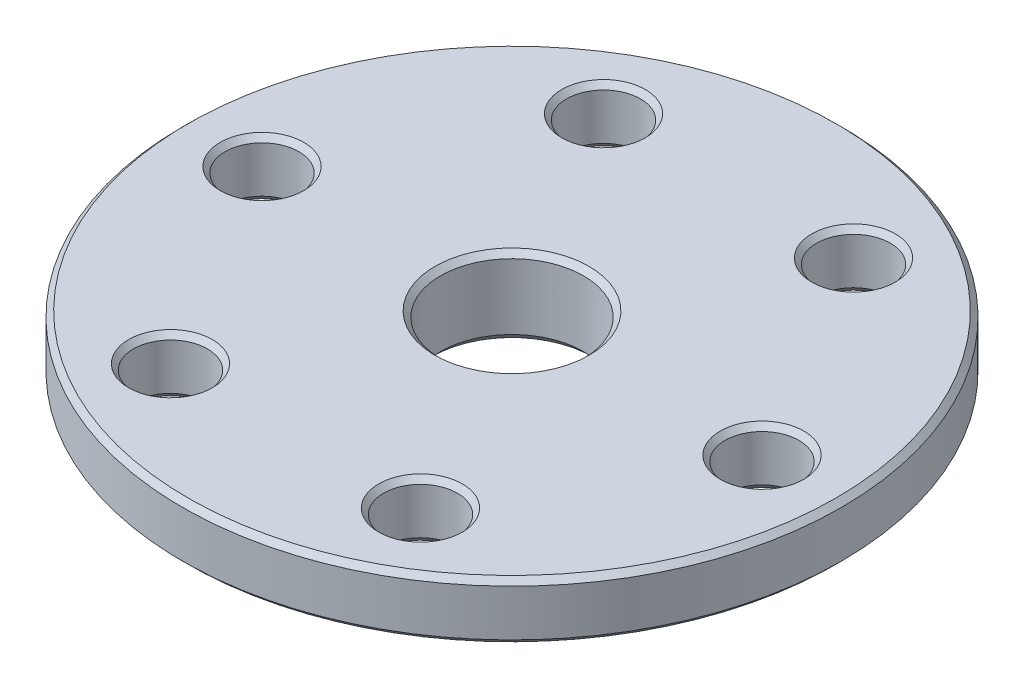
ISO-10303-21;
HEADER;
FILE_DESCRIPTION(('STEP AP214'),'2;1');
FILE_NAME('part.step','',(''),(''),'','','');
FILE_SCHEMA(('AUTOMOTIVE_DESIGN { 1 0 10303 214 1 1 1 1 }'));
ENDSEC;
DATA;
#1=APPLICATION_CONTEXT('core data for automotive mechanical design processes');
#2=APPLICATION_PROTOCOL_DEFINITION('international standard','automotive_design',2000,#1);
#3=PRODUCT_CONTEXT('',#1,'mechanical');
#4=PRODUCT('Part','Part','',(#3));
#5=PRODUCT_RELATED_PRODUCT_CATEGORY('part','',(#4));
#6=PRODUCT_DEFINITION_FORMATION('','',#4);
#7=PRODUCT_DEFINITION_CONTEXT('part definition',#1,'design');
#8=PRODUCT_DEFINITION('design','',#6,#7);
#9=PRODUCT_DEFINITION_SHAPE('','',#8);
#10=(LENGTH_UNIT() NAMED_UNIT(*) SI_UNIT(.MILLI.,.METRE.));
#11=(NAMED_UNIT(*) PLANE_ANGLE_UNIT() SI_UNIT($,.RADIAN.));
#12=(NAMED_UNIT(*) SI_UNIT($,.STERADIAN.) SOLID_ANGLE_UNIT());
#13=UNCERTAINTY_MEASURE_WITH_UNIT(LENGTH_MEASURE(1.E-05),#10,'distance_accuracy_value','');
#14=(GEOMETRIC_REPRESENTATION_CONTEXT(3) GLOBAL_UNCERTAINTY_ASSIGNED_CONTEXT((#13)) GLOBAL_UNIT_ASSIGNED_CONTEXT((#10,
#11,#12)) REPRESENTATION_CONTEXT('',''));
#15=CARTESIAN_POINT('',(0.,0.,0.));
#16=DIRECTION('',(0.,0.,1.));
#17=DIRECTION('',(1.,0.,0.));
#18=AXIS2_PLACEMENT_3D('',#15,#16,#17);
#19=CARTESIAN_POINT('',(0.,-8.71595519978993,0.));
#20=DIRECTION('',(0.,-1.,0.));
#21=DIRECTION('',(1.,0.,0.));
#22=AXIS2_PLACEMENT_3D('',#19,#20,#21);
#23=CYLINDRICAL_SURFACE('',#22,10.);
#24=CARTESIAN_POINT('',(0.,4.83800000000002,0.));
#25=DIRECTION('',(0.,-1.,0.));
#26=DIRECTION('',(1.,0.,0.));
#27=AXIS2_PLACEMENT_3D('',#24,#25,#26);
#28=CIRCLE('',#27,10.);
#29=CARTESIAN_POINT('',(10.,4.83800000000002,0.));
#30=VERTEX_POINT('',#29);
#31=EDGE_CURVE('E58',#30,#30,#28,.F.);
#32=ORIENTED_EDGE('',*,*,#31,.T.);
#33=EDGE_LOOP('',(#32));
#34=FACE_BOUND('',#33,.T.);
#35=CARTESIAN_POINT('',(0.,-4.33,0.));
#36=DIRECTION('',(0.,1.,0.));
#37=DIRECTION('',(-1.,0.,0.));
#38=AXIS2_PLACEMENT_3D('',#35,#36,#37);
#39=CIRCLE('',#38,10.);
#40=CARTESIAN_POINT('',(-10.,-4.33,0.));
#41=VERTEX_POINT('',#40);
#42=EDGE_CURVE('E83',#41,#41,#39,.F.);
#43=ORIENTED_EDGE('',*,*,#42,.T.);
#44=EDGE_LOOP('',(#43));
#45=FACE_BOUND('',#44,.T.);
#46=ADVANCED_FACE('F38',(#34,#45),#23,.F.);
#47=CARTESIAN_POINT('',(-46.0375,5.60000000000001,0.));
#48=DIRECTION('',(0.,-1.,0.));
#49=DIRECTION('',(1.,0.,0.));
#50=AXIS2_PLACEMENT_3D('',#47,#48,#49);
#51=PLANE('',#50);
#52=CARTESIAN_POINT('',(0.,5.60000000000001,0.));
#53=DIRECTION('',(0.,-1.,0.));
#54=DIRECTION('',(1.,0.,0.));
#55=AXIS2_PLACEMENT_3D('',#52,#53,#54);
#56=CIRCLE('',#55,45.2755);
#57=CARTESIAN_POINT('',(45.2755,5.60000000000001,0.));
#58=VERTEX_POINT('',#57);
#59=EDGE_CURVE('E64',#58,#58,#56,.F.);
#60=ORIENTED_EDGE('',*,*,#59,.T.);
#61=EDGE_LOOP('',(#60));
#62=FACE_BOUND('',#61,.T.);
#63=CARTESIAN_POINT('',(0.,5.60000000000001,0.));
#64=DIRECTION('',(0.,-1.,0.));
#65=DIRECTION('',(1.,0.,0.));
#66=AXIS2_PLACEMENT_3D('',#63,#64,#65);
#67=CIRCLE('',#66,10.762);
#68=CARTESIAN_POINT('',(10.762,5.60000000000001,0.));
#69=VERTEX_POINT('',#68);
#70=EDGE_CURVE('E68',#69,#69,#67,.T.);
#71=ORIENTED_EDGE('',*,*,#70,.T.);
#72=EDGE_LOOP('',(#71));
#73=FACE_BOUND('',#72,.T.);
#74=CARTESIAN_POINT('',(17.4625000000001,5.60000000000001,-30.2459372271714));
#75=DIRECTION('',(0.,1.,0.));
#76=DIRECTION('',(0.,0.,1.));
#77=AXIS2_PLACEMENT_3D('',#74,#75,#76);
#78=CIRCLE('',#77,5.842);
#79=CARTESIAN_POINT('',(17.4625000000001,5.60000000000001,-24.4039372271714));
#80=VERTEX_POINT('',#79);
#81=EDGE_CURVE('E170',#80,#80,#78,.T.);
#82=ORIENTED_EDGE('',*,*,#81,.F.);
#83=EDGE_LOOP('',(#82));
#84=FACE_BOUND('',#83,.T.);
#85=CARTESIAN_POINT('',(-17.4624999999999,5.60000000000001,-30.2459372271718));
#86=DIRECTION('',(0.,1.,0.));
#87=DIRECTION('',(0.,0.,1.));
#88=AXIS2_PLACEMENT_3D('',#85,#86,#87);
#89=CIRCLE('',#88,5.842);
#90=CARTESIAN_POINT('',(-17.4624999999999,5.60000000000001,-24.4039372271718));
#91=VERTEX_POINT('',#90);
#92=EDGE_CURVE('E154',#91,#91,#89,.T.);
#93=ORIENTED_EDGE('',*,*,#92,.F.);
#94=EDGE_LOOP('',(#93));
#95=FACE_BOUND('',#94,.T.);
#96=CARTESIAN_POINT('',(-34.9250000000001,5.60000000000001,-2.4980018054066E-13));
#97=DIRECTION('',(0.,1.,0.));
#98=DIRECTION('',(0.,0.,1.));
#99=AXIS2_PLACEMENT_3D('',#96,#97,#98);
#100=CIRCLE('',#99,5.842);
#101=CARTESIAN_POINT('',(-34.9250000000001,5.60000000000001,5.84199999999976));
#102=VERTEX_POINT('',#101);
#103=EDGE_CURVE('E138',#102,#102,#100,.T.);
#104=ORIENTED_EDGE('',*,*,#103,.F.);
#105=EDGE_LOOP('',(#104));
#106=FACE_BOUND('',#105,.T.);
#107=CARTESIAN_POINT('',(-17.4625000000002,5.60000000000002,30.2459372271716));
#108=DIRECTION('',(0.,1.,0.));
#109=DIRECTION('',(0.,0.,1.));
#110=AXIS2_PLACEMENT_3D('',#107,#108,#109);
#111=CIRCLE('',#110,5.842);
#112=CARTESIAN_POINT('',(-17.4625000000002,5.60000000000002,36.0879372271717));
#113=VERTEX_POINT('',#112);
#114=EDGE_CURVE('E122',#113,#113,#111,.T.);
#115=ORIENTED_EDGE('',*,*,#114,.F.);
#116=EDGE_LOOP('',(#115));
#117=FACE_BOUND('',#116,.T.);
#118=CARTESIAN_POINT('',(17.4624999999999,5.60000000000002,30.2459372271716));
#119=DIRECTION('',(0.,1.,0.));
#120=DIRECTION('',(0.,0.,1.));
#121=AXIS2_PLACEMENT_3D('',#118,#119,#120);
#122=CIRCLE('',#121,5.842);
#123=CARTESIAN_POINT('',(17.4624999999999,5.60000000000002,36.0879372271716));
#124=VERTEX_POINT('',#123);
#125=EDGE_CURVE('E106',#124,#124,#122,.T.);
#126=ORIENTED_EDGE('',*,*,#125,.F.);
#127=EDGE_LOOP('',(#126));
#128=FACE_BOUND('',#127,.T.);
#129=CARTESIAN_POINT('',(34.925,5.60000000000006,0.));
#130=DIRECTION('',(0.,1.,0.));
#131=DIRECTION('',(0.,0.,1.));
#132=AXIS2_PLACEMENT_3D('',#129,#130,#131);
#133=CIRCLE('',#132,5.842);
#134=CARTESIAN_POINT('',(34.925,5.60000000000006,5.84200000000001));
#135=VERTEX_POINT('',#134);
#136=EDGE_CURVE('E90',#135,#135,#133,.T.);
#137=ORIENTED_EDGE('',*,*,#136,.F.);
#138=EDGE_LOOP('',(#137));
#139=FACE_BOUND('',#138,.T.);
#140=ADVANCED_FACE('F210',(#62,#73,#84,#95,#106,#117,#128,#139),#51,.F.);
#141=CARTESIAN_POINT('',(0.,-8.71595519978993,0.));
#142=DIRECTION('',(0.,-1.,0.));
#143=DIRECTION('',(1.,0.,0.));
#144=AXIS2_PLACEMENT_3D('',#141,#142,#143);
#145=CYLINDRICAL_SURFACE('',#144,46.0375);
#146=CARTESIAN_POINT('',(0.,4.83800000000002,0.));
#147=DIRECTION('',(0.,-1.,0.));
#148=DIRECTION('',(1.,0.,0.));
#149=AXIS2_PLACEMENT_3D('',#146,#147,#148);
#150=CIRCLE('',#149,46.0375);
#151=CARTESIAN_POINT('',(46.0375,4.83800000000003,0.));
#152=VERTEX_POINT('',#151);
#153=EDGE_CURVE('E72',#152,#152,#150,.T.);
#154=ORIENTED_EDGE('',*,*,#153,.T.);
#155=EDGE_LOOP('',(#154));
#156=FACE_BOUND('',#155,.T.);
#157=CARTESIAN_POINT('',(0.,-1.66300000000004,0.));
#158=DIRECTION('',(0.,1.,0.));
#159=DIRECTION('',(-1.,0.,0.));
#160=AXIS2_PLACEMENT_3D('',#157,#158,#159);
#161=CIRCLE('',#160,46.0375);
#162=CARTESIAN_POINT('',(-46.0375,-1.66300000000005,0.));
#163=VERTEX_POINT('',#162);
#164=EDGE_CURVE('E76',#163,#163,#161,.T.);
#165=ORIENTED_EDGE('',*,*,#164,.T.);
#166=EDGE_LOOP('',(#165));
#167=FACE_BOUND('',#166,.T.);
#168=ADVANCED_FACE('F213',(#156,#167),#145,.T.);
#169=CARTESIAN_POINT('',(-46.0375,-2.425,0.));
#170=DIRECTION('',(0.,1.,0.));
#171=DIRECTION('',(-1.,0.,0.));
#172=AXIS2_PLACEMENT_3D('',#169,#170,#171);
#173=PLANE('',#172);
#174=CARTESIAN_POINT('',(0.,-2.425,0.));
#175=DIRECTION('',(0.,1.,0.));
#176=DIRECTION('',(-1.,0.,0.));
#177=AXIS2_PLACEMENT_3D('',#174,#175,#176);
#178=CIRCLE('',#177,45.2755);
#179=CARTESIAN_POINT('',(-45.2755,-2.425,0.));
#180=VERTEX_POINT('',#179);
#181=EDGE_CURVE('E52',#180,#180,#178,.F.);
#182=ORIENTED_EDGE('',*,*,#181,.T.);
#183=EDGE_LOOP('',(#182));
#184=FACE_BOUND('',#183,.T.);
#185=CARTESIAN_POINT('',(17.4625000000001,-2.42499999999998,-30.2459372271714));
#186=DIRECTION('',(0.,1.,0.));
#187=DIRECTION('',(0.,0.,1.));
#188=AXIS2_PLACEMENT_3D('',#185,#186,#187);
#189=CIRCLE('',#188,5.842);
#190=CARTESIAN_POINT('',(17.4625000000001,-2.42499999999998,-24.4039372271714));
#191=VERTEX_POINT('',#190);
#192=EDGE_CURVE('E182',#191,#191,#189,.T.);
#193=ORIENTED_EDGE('',*,*,#192,.T.);
#194=EDGE_LOOP('',(#193));
#195=FACE_BOUND('',#194,.T.);
#196=CARTESIAN_POINT('',(-17.4624999999999,-2.42499999999998,-30.2459372271718));
#197=DIRECTION('',(0.,1.,0.));
#198=DIRECTION('',(0.,0.,1.));
#199=AXIS2_PLACEMENT_3D('',#196,#197,#198);
#200=CIRCLE('',#199,5.842);
#201=CARTESIAN_POINT('',(-17.4624999999999,-2.42499999999998,-24.4039372271718));
#202=VERTEX_POINT('',#201);
#203=EDGE_CURVE('E166',#202,#202,#200,.T.);
#204=ORIENTED_EDGE('',*,*,#203,.T.);
#205=EDGE_LOOP('',(#204));
#206=FACE_BOUND('',#205,.T.);
#207=CARTESIAN_POINT('',(-34.925,-2.42499999999998,-2.4980018054066E-13));
#208=DIRECTION('',(0.,1.,0.));
#209=DIRECTION('',(0.,0.,1.));
#210=AXIS2_PLACEMENT_3D('',#207,#208,#209);
#211=CIRCLE('',#210,5.842);
#212=CARTESIAN_POINT('',(-34.925,-2.42499999999998,5.84199999999976));
#213=VERTEX_POINT('',#212);
#214=EDGE_CURVE('E150',#213,#213,#211,.T.);
#215=ORIENTED_EDGE('',*,*,#214,.T.);
#216=EDGE_LOOP('',(#215));
#217=FACE_BOUND('',#216,.T.);
#218=CARTESIAN_POINT('',(-17.4625000000002,-2.42499999999997,30.2459372271715));
#219=DIRECTION('',(0.,1.,0.));
#220=DIRECTION('',(0.,0.,1.));
#221=AXIS2_PLACEMENT_3D('',#218,#219,#220);
#222=CIRCLE('',#221,5.842);
#223=CARTESIAN_POINT('',(-17.4625000000002,-2.42499999999997,36.0879372271715));
#224=VERTEX_POINT('',#223);
#225=EDGE_CURVE('E134',#224,#224,#222,.T.);
#226=ORIENTED_EDGE('',*,*,#225,.T.);
#227=EDGE_LOOP('',(#226));
#228=FACE_BOUND('',#227,.T.);
#229=CARTESIAN_POINT('',(17.4624999999999,-2.42499999999997,30.2459372271716));
#230=DIRECTION('',(0.,1.,0.));
#231=DIRECTION('',(0.,0.,1.));
#232=AXIS2_PLACEMENT_3D('',#229,#230,#231);
#233=CIRCLE('',#232,5.842);
#234=CARTESIAN_POINT('',(17.4624999999999,-2.42499999999997,36.0879372271716));
#235=VERTEX_POINT('',#234);
#236=EDGE_CURVE('E118',#235,#235,#233,.T.);
#237=ORIENTED_EDGE('',*,*,#236,.T.);
#238=EDGE_LOOP('',(#237));
#239=FACE_BOUND('',#238,.T.);
#240=CARTESIAN_POINT('',(34.925,-2.42499999999994,0.));
#241=DIRECTION('',(0.,1.,0.));
#242=DIRECTION('',(0.,0.,1.));
#243=AXIS2_PLACEMENT_3D('',#240,#241,#242);
#244=CIRCLE('',#243,5.842);
#245=CARTESIAN_POINT('',(34.925,-2.42499999999994,5.84200000000001));
#246=VERTEX_POINT('',#245);
#247=EDGE_CURVE('E102',#246,#246,#244,.T.);
#248=ORIENTED_EDGE('',*,*,#247,.T.);
#249=EDGE_LOOP('',(#248));
#250=FACE_BOUND('',#249,.T.);
#251=CARTESIAN_POINT('',(0.,-2.425,0.));
#252=DIRECTION('',(0.,-1.,0.));
#253=DIRECTION('',(1.,0.,0.));
#254=AXIS2_PLACEMENT_3D('',#251,#252,#253);
#255=CIRCLE('',#254,25.3873);
#256=CARTESIAN_POINT('',(25.3873,-2.42499999999999,0.));
#257=VERTEX_POINT('',#256);
#258=EDGE_CURVE('E87',#257,#257,#255,.T.);
#259=ORIENTED_EDGE('',*,*,#258,.F.);
#260=EDGE_LOOP('',(#259));
#261=FACE_BOUND('',#260,.T.);
#262=ADVANCED_FACE('F187',(#184,#195,#206,#217,#228,#239,#250,#261),#173,.F.);
#263=CARTESIAN_POINT('',(0.,-8.71595519978993,0.));
#264=DIRECTION('',(0.,-1.,0.));
#265=DIRECTION('',(1.,0.,0.));
#266=AXIS2_PLACEMENT_3D('',#263,#264,#265);
#267=CYLINDRICAL_SURFACE('',#266,25.3873);
#268=CARTESIAN_POINT('',(0.,-4.83800000000004,0.));
#269=DIRECTION('',(0.,1.,0.));
#270=DIRECTION('',(-1.,0.,0.));
#271=AXIS2_PLACEMENT_3D('',#268,#269,#270);
#272=CIRCLE('',#271,25.3873);
#273=CARTESIAN_POINT('',(-25.3873,-4.83800000000004,0.));
#274=VERTEX_POINT('',#273);
#275=EDGE_CURVE('E10',#274,#274,#272,.T.);
#276=ORIENTED_EDGE('',*,*,#275,.T.);
#277=EDGE_LOOP('',(#276));
#278=FACE_BOUND('',#277,.T.);
#279=ORIENTED_EDGE('',*,*,#258,.T.);
#280=EDGE_LOOP('',(#279));
#281=FACE_BOUND('',#280,.T.);
#282=ADVANCED_FACE('F239',(#278,#281),#267,.T.);
#283=CARTESIAN_POINT('',(-10.,-5.59999999999999,0.));
#284=DIRECTION('',(0.,1.,0.));
#285=DIRECTION('',(-1.,0.,0.));
#286=AXIS2_PLACEMENT_3D('',#283,#284,#285);
#287=PLANE('',#286);
#288=CARTESIAN_POINT('',(0.,-5.59999999999999,0.));
#289=DIRECTION('',(0.,1.,0.));
#290=DIRECTION('',(-1.,0.,0.));
#291=AXIS2_PLACEMENT_3D('',#288,#289,#290);
#292=CIRCLE('',#291,24.6253);
#293=CARTESIAN_POINT('',(-24.6253000000001,-5.6,0.));
#294=VERTEX_POINT('',#293);
#295=EDGE_CURVE('E46',#294,#294,#292,.F.);
#296=ORIENTED_EDGE('',*,*,#295,.T.);
#297=EDGE_LOOP('',(#296));
#298=FACE_BOUND('',#297,.T.);
#299=CARTESIAN_POINT('',(0.,-5.59999999999999,0.));
#300=DIRECTION('',(0.,1.,0.));
#301=DIRECTION('',(-1.,0.,0.));
#302=AXIS2_PLACEMENT_3D('',#299,#300,#301);
#303=CIRCLE('',#302,11.27);
#304=CARTESIAN_POINT('',(-11.27,-5.6,0.));
#305=VERTEX_POINT('',#304);
#306=EDGE_CURVE('E80',#305,#305,#303,.T.);
#307=ORIENTED_EDGE('',*,*,#306,.T.);
#308=EDGE_LOOP('',(#307));
#309=FACE_BOUND('',#308,.T.);
#310=ADVANCED_FACE('F229',(#298,#309),#287,.F.);
#311=CARTESIAN_POINT('',(34.925,5.60000000000006,0.));
#312=DIRECTION('',(0.,1.,0.));
#313=DIRECTION('',(0.,0.,1.));
#314=AXIS2_PLACEMENT_3D('',#311,#312,#313);
#315=CONICAL_SURFACE('',#314,5.842,0.715584993317674);
#316=CARTESIAN_POINT('',(34.925,4.81399928208223,0.));
#317=DIRECTION('',(0.,1.,0.));
#318=DIRECTION('',(0.,0.,1.));
#319=AXIS2_PLACEMENT_3D('',#316,#317,#318);
#320=CIRCLE('',#319,5.15874);
#321=CARTESIAN_POINT('',(34.925,4.81399928208223,5.15874000000001));
#322=VERTEX_POINT('',#321);
#323=EDGE_CURVE('E94',#322,#322,#320,.T.);
#324=ORIENTED_EDGE('',*,*,#323,.F.);
#325=EDGE_LOOP('',(#324));
#326=FACE_BOUND('',#325,.T.);
#327=ORIENTED_EDGE('',*,*,#136,.T.);
#328=EDGE_LOOP('',(#327));
#329=FACE_BOUND('',#328,.T.);
#330=ADVANCED_FACE('F226',(#326,#329),#315,.F.);
#331=CARTESIAN_POINT('',(34.925,5.60000000000006,0.));
#332=DIRECTION('',(0.,1.,0.));
#333=DIRECTION('',(0.,0.,1.));
#334=AXIS2_PLACEMENT_3D('',#331,#332,#333);
#335=CYLINDRICAL_SURFACE('',#334,5.15874);
#336=CARTESIAN_POINT('',(34.925,-1.63899928208211,0.));
#337=DIRECTION('',(0.,1.,0.));
#338=DIRECTION('',(0.,0.,1.));
#339=AXIS2_PLACEMENT_3D('',#336,#337,#338);
#340=CIRCLE('',#339,5.15873999999999);
#341=CARTESIAN_POINT('',(34.925,-1.63899928208211,5.15874));
#342=VERTEX_POINT('',#341);
#343=EDGE_CURVE('E98',#342,#342,#340,.T.);
#344=ORIENTED_EDGE('',*,*,#343,.F.);
#345=EDGE_LOOP('',(#344));
#346=FACE_BOUND('',#345,.T.);
#347=ORIENTED_EDGE('',*,*,#323,.T.);
#348=EDGE_LOOP('',(#347));
#349=FACE_BOUND('',#348,.T.);
#350=ADVANCED_FACE('F228',(#346,#349),#335,.F.);
#351=CARTESIAN_POINT('',(34.925,-1.63899928208211,0.));
#352=DIRECTION('',(0.,-1.,0.));
#353=DIRECTION('',(0.,0.,-1.));
#354=AXIS2_PLACEMENT_3D('',#351,#352,#353);
#355=CONICAL_SURFACE('',#354,5.15873999999999,0.715584993317678);
#356=ORIENTED_EDGE('',*,*,#247,.F.);
#357=EDGE_LOOP('',(#356));
#358=FACE_BOUND('',#357,.T.);
#359=ORIENTED_EDGE('',*,*,#343,.T.);
#360=EDGE_LOOP('',(#359));
#361=FACE_BOUND('',#360,.T.);
#362=ADVANCED_FACE('F236',(#358,#361),#355,.F.);
#363=CARTESIAN_POINT('',(17.4624999999999,5.60000000000002,30.2459372271716));
#364=DIRECTION('',(0.,1.,0.));
#365=DIRECTION('',(0.,0.,1.));
#366=AXIS2_PLACEMENT_3D('',#363,#364,#365);
#367=CONICAL_SURFACE('',#366,5.842,0.715584993317677);
#368=CARTESIAN_POINT('',(17.4624999999999,4.8139992820822,30.2459372271716));
#369=DIRECTION('',(0.,1.,0.));
#370=DIRECTION('',(0.,0.,1.));
#371=AXIS2_PLACEMENT_3D('',#368,#369,#370);
#372=CIRCLE('',#371,5.15874);
#373=CARTESIAN_POINT('',(17.4624999999999,4.8139992820822,35.4046772271716));
#374=VERTEX_POINT('',#373);
#375=EDGE_CURVE('E110',#374,#374,#372,.T.);
#376=ORIENTED_EDGE('',*,*,#375,.F.);
#377=EDGE_LOOP('',(#376));
#378=FACE_BOUND('',#377,.T.);
#379=ORIENTED_EDGE('',*,*,#125,.T.);
#380=EDGE_LOOP('',(#379));
#381=FACE_BOUND('',#380,.T.);
#382=ADVANCED_FACE('F335',(#378,#381),#367,.F.);
#383=CARTESIAN_POINT('',(17.4624999999999,5.60000000000002,30.2459372271716));
#384=DIRECTION('',(0.,1.,0.));
#385=DIRECTION('',(0.,0.,1.));
#386=AXIS2_PLACEMENT_3D('',#383,#384,#385);
#387=CYLINDRICAL_SURFACE('',#386,5.15874);
#388=CARTESIAN_POINT('',(17.4624999999999,-1.63899928208214,30.2459372271716));
#389=DIRECTION('',(0.,1.,0.));
#390=DIRECTION('',(0.,0.,1.));
#391=AXIS2_PLACEMENT_3D('',#388,#389,#390);
#392=CIRCLE('',#391,5.15874);
#393=CARTESIAN_POINT('',(17.4624999999999,-1.63899928208214,35.4046772271716));
#394=VERTEX_POINT('',#393);
#395=EDGE_CURVE('E114',#394,#394,#392,.T.);
#396=ORIENTED_EDGE('',*,*,#395,.F.);
#397=EDGE_LOOP('',(#396));
#398=FACE_BOUND('',#397,.T.);
#399=ORIENTED_EDGE('',*,*,#375,.T.);
#400=EDGE_LOOP('',(#399));
#401=FACE_BOUND('',#400,.T.);
#402=ADVANCED_FACE('F345',(#398,#401),#387,.F.);
#403=CARTESIAN_POINT('',(17.4624999999999,-1.63899928208214,30.2459372271716));
#404=DIRECTION('',(0.,-1.,0.));
#405=DIRECTION('',(0.,0.,-1.));
#406=AXIS2_PLACEMENT_3D('',#403,#404,#405);
#407=CONICAL_SURFACE('',#406,5.15874,0.715584993317673);
#408=ORIENTED_EDGE('',*,*,#236,.F.);
#409=EDGE_LOOP('',(#408));
#410=FACE_BOUND('',#409,.T.);
#411=ORIENTED_EDGE('',*,*,#395,.T.);
#412=EDGE_LOOP('',(#411));
#413=FACE_BOUND('',#412,.T.);
#414=ADVANCED_FACE('F355',(#410,#413),#407,.F.);
#415=CARTESIAN_POINT('',(-17.4625000000002,5.60000000000002,30.2459372271716));
#416=DIRECTION('',(0.,1.,0.));
#417=DIRECTION('',(0.,0.,1.));
#418=AXIS2_PLACEMENT_3D('',#415,#416,#417);
#419=CONICAL_SURFACE('',#418,5.842,0.715584993317677);
#420=CARTESIAN_POINT('',(-17.4625000000002,4.8139992820822,30.2459372271716));
#421=DIRECTION('',(0.,1.,0.));
#422=DIRECTION('',(0.,0.,1.));
#423=AXIS2_PLACEMENT_3D('',#420,#421,#422);
#424=CIRCLE('',#423,5.15874);
#425=CARTESIAN_POINT('',(-17.4625000000002,4.8139992820822,35.4046772271717));
#426=VERTEX_POINT('',#425);
#427=EDGE_CURVE('E126',#426,#426,#424,.T.);
#428=ORIENTED_EDGE('',*,*,#427,.F.);
#429=EDGE_LOOP('',(#428));
#430=FACE_BOUND('',#429,.T.);
#431=ORIENTED_EDGE('',*,*,#114,.T.);
#432=EDGE_LOOP('',(#431));
#433=FACE_BOUND('',#432,.T.);
#434=ADVANCED_FACE('F365',(#430,#433),#419,.F.);
#435=CARTESIAN_POINT('',(-17.4625000000002,5.60000000000002,30.2459372271716));
#436=DIRECTION('',(0.,1.,0.));
#437=DIRECTION('',(0.,0.,1.));
#438=AXIS2_PLACEMENT_3D('',#435,#436,#437);
#439=CYLINDRICAL_SURFACE('',#438,5.15874);
#440=CARTESIAN_POINT('',(-17.4625000000002,-1.63899928208214,30.2459372271715));
#441=DIRECTION('',(0.,1.,0.));
#442=DIRECTION('',(0.,0.,1.));
#443=AXIS2_PLACEMENT_3D('',#440,#441,#442);
#444=CIRCLE('',#443,5.15874);
#445=CARTESIAN_POINT('',(-17.4625000000002,-1.63899928208214,35.4046772271715));
#446=VERTEX_POINT('',#445);
#447=EDGE_CURVE('E130',#446,#446,#444,.T.);
#448=ORIENTED_EDGE('',*,*,#447,.F.);
#449=EDGE_LOOP('',(#448));
#450=FACE_BOUND('',#449,.T.);
#451=ORIENTED_EDGE('',*,*,#427,.T.);
#452=EDGE_LOOP('',(#451));
#453=FACE_BOUND('',#452,.T.);
#454=ADVANCED_FACE('F375',(#450,#453),#439,.F.);
#455=CARTESIAN_POINT('',(-17.4625000000002,-1.63899928208214,30.2459372271715));
#456=DIRECTION('',(0.,-1.,0.));
#457=DIRECTION('',(0.,0.,-1.));
#458=AXIS2_PLACEMENT_3D('',#455,#456,#457);
#459=CONICAL_SURFACE('',#458,5.15874,0.715584993317674);
#460=ORIENTED_EDGE('',*,*,#225,.F.);
#461=EDGE_LOOP('',(#460));
#462=FACE_BOUND('',#461,.T.);
#463=ORIENTED_EDGE('',*,*,#447,.T.);
#464=EDGE_LOOP('',(#463));
#465=FACE_BOUND('',#464,.T.);
#466=ADVANCED_FACE('F385',(#462,#465),#459,.F.);
#467=CARTESIAN_POINT('',(-34.9250000000001,5.60000000000001,-2.4980018054066E-13));
#468=DIRECTION('',(0.,1.,0.));
#469=DIRECTION('',(0.,0.,1.));
#470=AXIS2_PLACEMENT_3D('',#467,#468,#469);
#471=CONICAL_SURFACE('',#470,5.842,0.715584993317677);
#472=CARTESIAN_POINT('',(-34.9250000000001,4.81399928208218,-2.4980018054066E-13));
#473=DIRECTION('',(0.,1.,0.));
#474=DIRECTION('',(0.,0.,1.));
#475=AXIS2_PLACEMENT_3D('',#472,#473,#474);
#476=CIRCLE('',#475,5.15874);
#477=CARTESIAN_POINT('',(-34.9250000000001,4.81399928208218,5.15873999999976));
#478=VERTEX_POINT('',#477);
#479=EDGE_CURVE('E142',#478,#478,#476,.T.);
#480=ORIENTED_EDGE('',*,*,#479,.F.);
#481=EDGE_LOOP('',(#480));
#482=FACE_BOUND('',#481,.T.);
#483=ORIENTED_EDGE('',*,*,#103,.T.);
#484=EDGE_LOOP('',(#483));
#485=FACE_BOUND('',#484,.T.);
#486=ADVANCED_FACE('F395',(#482,#485),#471,.F.);
#487=CARTESIAN_POINT('',(-34.9250000000001,5.60000000000001,-2.4980018054066E-13));
#488=DIRECTION('',(0.,1.,0.));
#489=DIRECTION('',(0.,0.,1.));
#490=AXIS2_PLACEMENT_3D('',#487,#488,#489);
#491=CYLINDRICAL_SURFACE('',#490,5.15874);
#492=CARTESIAN_POINT('',(-34.925,-1.63899928208217,-2.4980018054066E-13));
#493=DIRECTION('',(0.,1.,0.));
#494=DIRECTION('',(0.,0.,1.));
#495=AXIS2_PLACEMENT_3D('',#492,#493,#494);
#496=CIRCLE('',#495,5.15874);
#497=CARTESIAN_POINT('',(-34.925,-1.63899928208217,5.15873999999976));
#498=VERTEX_POINT('',#497);
#499=EDGE_CURVE('E146',#498,#498,#496,.T.);
#500=ORIENTED_EDGE('',*,*,#499,.F.);
#501=EDGE_LOOP('',(#500));
#502=FACE_BOUND('',#501,.T.);
#503=ORIENTED_EDGE('',*,*,#479,.T.);
#504=EDGE_LOOP('',(#503));
#505=FACE_BOUND('',#504,.T.);
#506=ADVANCED_FACE('F405',(#502,#505),#491,.F.);
#507=CARTESIAN_POINT('',(-34.925,-1.63899928208217,-2.4980018054066E-13));
#508=DIRECTION('',(0.,-1.,0.));
#509=DIRECTION('',(0.,0.,-1.));
#510=AXIS2_PLACEMENT_3D('',#507,#508,#509);
#511=CONICAL_SURFACE('',#510,5.15874,0.715584993317676);
#512=ORIENTED_EDGE('',*,*,#214,.F.);
#513=EDGE_LOOP('',(#512));
#514=FACE_BOUND('',#513,.T.);
#515=ORIENTED_EDGE('',*,*,#499,.T.);
#516=EDGE_LOOP('',(#515));
#517=FACE_BOUND('',#516,.T.);
#518=ADVANCED_FACE('F415',(#514,#517),#511,.F.);
#519=CARTESIAN_POINT('',(-17.4624999999999,5.60000000000001,-30.2459372271718));
#520=DIRECTION('',(0.,1.,0.));
#521=DIRECTION('',(0.,0.,1.));
#522=AXIS2_PLACEMENT_3D('',#519,#520,#521);
#523=CONICAL_SURFACE('',#522,5.842,0.715584993317677);
#524=CARTESIAN_POINT('',(-17.4624999999999,4.81399928208218,-30.2459372271718));
#525=DIRECTION('',(0.,1.,0.));
#526=DIRECTION('',(0.,0.,1.));
#527=AXIS2_PLACEMENT_3D('',#524,#525,#526);
#528=CIRCLE('',#527,5.15874);
#529=CARTESIAN_POINT('',(-17.4624999999999,4.81399928208218,-25.0871972271718));
#530=VERTEX_POINT('',#529);
#531=EDGE_CURVE('E158',#530,#530,#528,.T.);
#532=ORIENTED_EDGE('',*,*,#531,.F.);
#533=EDGE_LOOP('',(#532));
#534=FACE_BOUND('',#533,.T.);
#535=ORIENTED_EDGE('',*,*,#92,.T.);
#536=EDGE_LOOP('',(#535));
#537=FACE_BOUND('',#536,.T.);
#538=ADVANCED_FACE('F425',(#534,#537),#523,.F.);
#539=CARTESIAN_POINT('',(-17.4624999999999,5.60000000000001,-30.2459372271718));
#540=DIRECTION('',(0.,1.,0.));
#541=DIRECTION('',(0.,0.,1.));
#542=AXIS2_PLACEMENT_3D('',#539,#540,#541);
#543=CYLINDRICAL_SURFACE('',#542,5.15874);
#544=CARTESIAN_POINT('',(-17.4624999999999,-1.63899928208215,-30.2459372271718));
#545=DIRECTION('',(0.,1.,0.));
#546=DIRECTION('',(0.,0.,1.));
#547=AXIS2_PLACEMENT_3D('',#544,#545,#546);
#548=CIRCLE('',#547,5.15874);
#549=CARTESIAN_POINT('',(-17.4624999999999,-1.63899928208215,-25.0871972271718));
#550=VERTEX_POINT('',#549);
#551=EDGE_CURVE('E162',#550,#550,#548,.T.);
#552=ORIENTED_EDGE('',*,*,#551,.F.);
#553=EDGE_LOOP('',(#552));
#554=FACE_BOUND('',#553,.T.);
#555=ORIENTED_EDGE('',*,*,#531,.T.);
#556=EDGE_LOOP('',(#555));
#557=FACE_BOUND('',#556,.T.);
#558=ADVANCED_FACE('F435',(#554,#557),#543,.F.);
#559=CARTESIAN_POINT('',(-17.4624999999999,-1.63899928208215,-30.2459372271718));
#560=DIRECTION('',(0.,-1.,0.));
#561=DIRECTION('',(0.,0.,-1.));
#562=AXIS2_PLACEMENT_3D('',#559,#560,#561);
#563=CONICAL_SURFACE('',#562,5.15874,0.715584993317674);
#564=ORIENTED_EDGE('',*,*,#203,.F.);
#565=EDGE_LOOP('',(#564));
#566=FACE_BOUND('',#565,.T.);
#567=ORIENTED_EDGE('',*,*,#551,.T.);
#568=EDGE_LOOP('',(#567));
#569=FACE_BOUND('',#568,.T.);
#570=ADVANCED_FACE('F206',(#566,#569),#563,.F.);
#571=CARTESIAN_POINT('',(17.4625000000001,5.60000000000001,-30.2459372271714));
#572=DIRECTION('',(0.,1.,0.));
#573=DIRECTION('',(0.,0.,1.));
#574=AXIS2_PLACEMENT_3D('',#571,#572,#573);
#575=CONICAL_SURFACE('',#574,5.842,0.715584993317677);
#576=CARTESIAN_POINT('',(17.4625000000001,4.81399928208219,-30.2459372271714));
#577=DIRECTION('',(0.,1.,0.));
#578=DIRECTION('',(0.,0.,1.));
#579=AXIS2_PLACEMENT_3D('',#576,#577,#578);
#580=CIRCLE('',#579,5.15874);
#581=CARTESIAN_POINT('',(17.4625000000001,4.81399928208219,-25.0871972271714));
#582=VERTEX_POINT('',#581);
#583=EDGE_CURVE('E174',#582,#582,#580,.T.);
#584=ORIENTED_EDGE('',*,*,#583,.F.);
#585=EDGE_LOOP('',(#584));
#586=FACE_BOUND('',#585,.T.);
#587=ORIENTED_EDGE('',*,*,#81,.T.);
#588=EDGE_LOOP('',(#587));
#589=FACE_BOUND('',#588,.T.);
#590=ADVANCED_FACE('F200',(#586,#589),#575,.F.);
#591=CARTESIAN_POINT('',(17.4625000000001,5.60000000000001,-30.2459372271714));
#592=DIRECTION('',(0.,1.,0.));
#593=DIRECTION('',(0.,0.,1.));
#594=AXIS2_PLACEMENT_3D('',#591,#592,#593);
#595=CYLINDRICAL_SURFACE('',#594,5.15874);
#596=CARTESIAN_POINT('',(17.4625000000001,-1.63899928208215,-30.2459372271714));
#597=DIRECTION('',(0.,1.,0.));
#598=DIRECTION('',(0.,0.,1.));
#599=AXIS2_PLACEMENT_3D('',#596,#597,#598);
#600=CIRCLE('',#599,5.15874);
#601=CARTESIAN_POINT('',(17.4625000000001,-1.63899928208215,-25.0871972271714));
#602=VERTEX_POINT('',#601);
#603=EDGE_CURVE('E178',#602,#602,#600,.T.);
#604=ORIENTED_EDGE('',*,*,#603,.F.);
#605=EDGE_LOOP('',(#604));
#606=FACE_BOUND('',#605,.T.);
#607=ORIENTED_EDGE('',*,*,#583,.T.);
#608=EDGE_LOOP('',(#607));
#609=FACE_BOUND('',#608,.T.);
#610=ADVANCED_FACE('F194',(#606,#609),#595,.F.);
#611=CARTESIAN_POINT('',(17.4625000000001,-1.63899928208215,-30.2459372271714));
#612=DIRECTION('',(0.,-1.,0.));
#613=DIRECTION('',(0.,0.,-1.));
#614=AXIS2_PLACEMENT_3D('',#611,#612,#613);
#615=CONICAL_SURFACE('',#614,5.15874,0.715584993317673);
#616=ORIENTED_EDGE('',*,*,#192,.F.);
#617=EDGE_LOOP('',(#616));
#618=FACE_BOUND('',#617,.T.);
#619=ORIENTED_EDGE('',*,*,#603,.T.);
#620=EDGE_LOOP('',(#619));
#621=FACE_BOUND('',#620,.T.);
#622=ADVANCED_FACE('F190',(#618,#621),#615,.F.);
#623=CARTESIAN_POINT('',(0.,-4.33,0.));
#624=DIRECTION('',(0.,-1.,0.));
#625=DIRECTION('',(1.,0.,0.));
#626=AXIS2_PLACEMENT_3D('',#623,#624,#625);
#627=CONICAL_SURFACE('',#626,10.,0.785398163397457);
#628=ORIENTED_EDGE('',*,*,#306,.F.);
#629=EDGE_LOOP('',(#628));
#630=FACE_BOUND('',#629,.T.);
#631=ORIENTED_EDGE('',*,*,#42,.F.);
#632=EDGE_LOOP('',(#631));
#633=FACE_BOUND('',#632,.T.);
#634=ADVANCED_FACE('F193',(#630,#633),#627,.F.);
#635=CARTESIAN_POINT('',(0.,4.83800000000002,0.));
#636=DIRECTION('',(0.,-1.,0.));
#637=DIRECTION('',(1.,0.,0.));
#638=AXIS2_PLACEMENT_3D('',#635,#636,#637);
#639=CONICAL_SURFACE('',#638,46.0375,0.785398163397457);
#640=ORIENTED_EDGE('',*,*,#59,.F.);
#641=EDGE_LOOP('',(#640));
#642=FACE_BOUND('',#641,.T.);
#643=ORIENTED_EDGE('',*,*,#153,.F.);
#644=EDGE_LOOP('',(#643));
#645=FACE_BOUND('',#644,.T.);
#646=ADVANCED_FACE('F252',(#642,#645),#639,.T.);
#647=CARTESIAN_POINT('',(0.,5.60000000000001,0.));
#648=DIRECTION('',(0.,1.,0.));
#649=DIRECTION('',(-1.,0.,0.));
#650=AXIS2_PLACEMENT_3D('',#647,#648,#649);
#651=CONICAL_SURFACE('',#650,10.762,0.785398163397444);
#652=ORIENTED_EDGE('',*,*,#31,.F.);
#653=EDGE_LOOP('',(#652));
#654=FACE_BOUND('',#653,.T.);
#655=ORIENTED_EDGE('',*,*,#70,.F.);
#656=EDGE_LOOP('',(#655));
#657=FACE_BOUND('',#656,.T.);
#658=ADVANCED_FACE('F256',(#654,#657),#651,.F.);
#659=CARTESIAN_POINT('',(0.,-2.425,0.));
#660=DIRECTION('',(0.,1.,0.));
#661=DIRECTION('',(-1.,0.,0.));
#662=AXIS2_PLACEMENT_3D('',#659,#660,#661);
#663=CONICAL_SURFACE('',#662,45.2755,0.785398163397457);
#664=ORIENTED_EDGE('',*,*,#164,.F.);
#665=EDGE_LOOP('',(#664));
#666=FACE_BOUND('',#665,.T.);
#667=ORIENTED_EDGE('',*,*,#181,.F.);
#668=EDGE_LOOP('',(#667));
#669=FACE_BOUND('',#668,.T.);
#670=ADVANCED_FACE('F259',(#666,#669),#663,.T.);
#671=CARTESIAN_POINT('',(0.,-5.59999999999999,0.));
#672=DIRECTION('',(0.,1.,0.));
#673=DIRECTION('',(-1.,0.,0.));
#674=AXIS2_PLACEMENT_3D('',#671,#672,#673);
#675=CONICAL_SURFACE('',#674,24.6253,0.785398163397446);
#676=ORIENTED_EDGE('',*,*,#275,.F.);
#677=EDGE_LOOP('',(#676));
#678=FACE_BOUND('',#677,.T.);
#679=ORIENTED_EDGE('',*,*,#295,.F.);
#680=EDGE_LOOP('',(#679));
#681=FACE_BOUND('',#680,.T.);
#682=ADVANCED_FACE('F40',(#678,#681),#675,.T.);
#683=CLOSED_SHELL('',(#46,#140,#168,#262,#282,#310,#330,#350,#362,#382,#402,#414,#434,#454,#466,
#486,#506,#518,#538,#558,#570,#590,#610,#622,#634,#646,#658,#670,#682));
#684=MANIFOLD_SOLID_BREP('B2',#683);
#685=ADVANCED_BREP_SHAPE_REPRESENTATION('',(#18,#684),#14);
#686=SHAPE_DEFINITION_REPRESENTATION(#9,#685);
ENDSEC;
END-ISO-10303-21;
